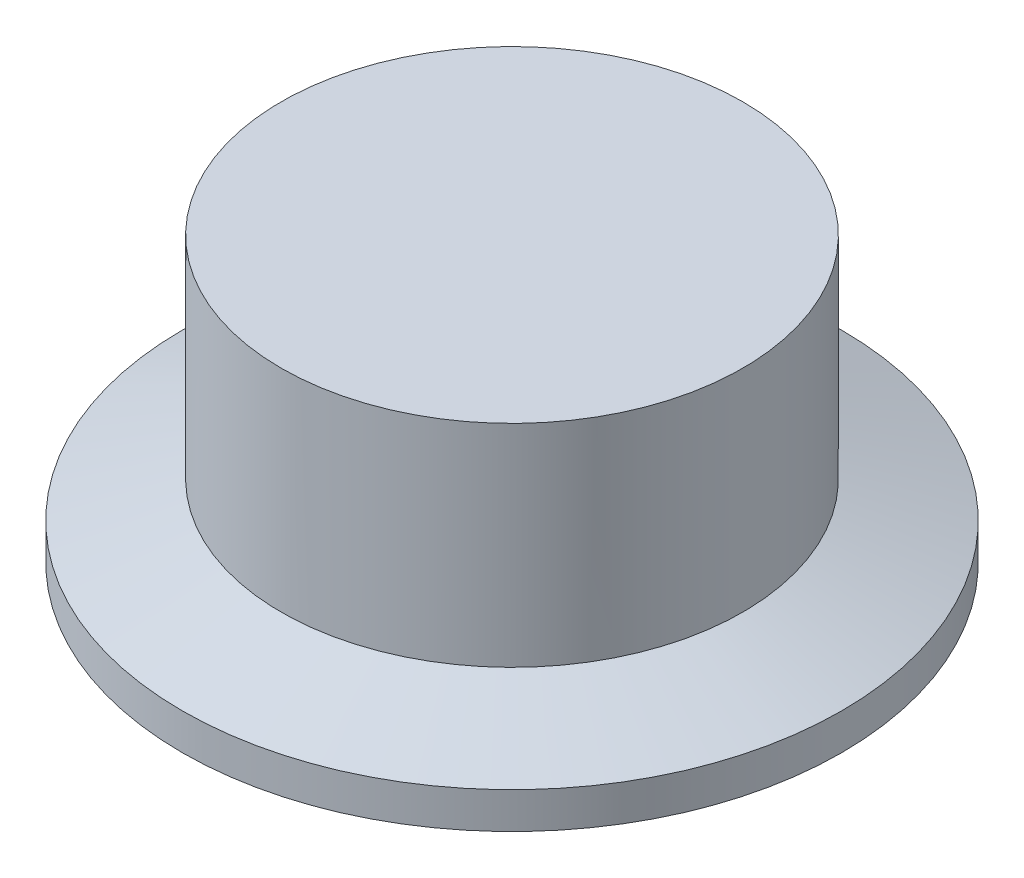
ISO-10303-21;
HEADER;
FILE_DESCRIPTION(('STEP AP214'),'2;1');
FILE_NAME('part.step','',(''),(''),'','','');
FILE_SCHEMA(('AUTOMOTIVE_DESIGN { 1 0 10303 214 1 1 1 1 }'));
ENDSEC;
DATA;
#1=APPLICATION_CONTEXT('core data for automotive mechanical design processes');
#2=APPLICATION_PROTOCOL_DEFINITION('international standard','automotive_design',2000,#1);
#3=PRODUCT_CONTEXT('',#1,'mechanical');
#4=PRODUCT('Part','Part','',(#3));
#5=PRODUCT_RELATED_PRODUCT_CATEGORY('part','',(#4));
#6=PRODUCT_DEFINITION_FORMATION('','',#4);
#7=PRODUCT_DEFINITION_CONTEXT('part definition',#1,'design');
#8=PRODUCT_DEFINITION('design','',#6,#7);
#9=PRODUCT_DEFINITION_SHAPE('','',#8);
#10=(LENGTH_UNIT() NAMED_UNIT(*) SI_UNIT(.MILLI.,.METRE.));
#11=(NAMED_UNIT(*) PLANE_ANGLE_UNIT() SI_UNIT($,.RADIAN.));
#12=(NAMED_UNIT(*) SI_UNIT($,.STERADIAN.) SOLID_ANGLE_UNIT());
#13=UNCERTAINTY_MEASURE_WITH_UNIT(LENGTH_MEASURE(1.E-05),#10,'distance_accuracy_value','');
#14=(GEOMETRIC_REPRESENTATION_CONTEXT(3) GLOBAL_UNCERTAINTY_ASSIGNED_CONTEXT((#13)) GLOBAL_UNIT_ASSIGNED_CONTEXT((#10,
#11,#12)) REPRESENTATION_CONTEXT('',''));
#15=CARTESIAN_POINT('',(0.,0.,0.));
#16=DIRECTION('',(0.,0.,1.));
#17=DIRECTION('',(1.,0.,0.));
#18=AXIS2_PLACEMENT_3D('',#15,#16,#17);
#19=CARTESIAN_POINT('',(0.,1.27000000000001,0.));
#20=CARTESIAN_POINT('',(-5.11970880183634,1.51290112684334,0.));
#21=CARTESIAN_POINT('',(-13.6851987767612,-0.496611023304067,0.));
#22=CARTESIAN_POINT('',(-22.1584771281244,-2.93975728273693,0.));
#23=CARTESIAN_POINT('',(-25.4,-4.82599999999999,0.));
#24=B_SPLINE_CURVE_WITH_KNOTS('',3,(#19,#20,#21,#22,#23),.UNSPECIFIED.,.F.,.F.,(4,1,4),(0.,
0.575798634465764,1.),.UNSPECIFIED.);
#25=CARTESIAN_POINT('',(0.,-18.3275304414003,0.));
#26=DIRECTION('',(0.,-1.,0.));
#27=AXIS1_PLACEMENT('',#25,#26);
#28=SURFACE_OF_REVOLUTION('',#24,#27);
#29=CARTESIAN_POINT('',(0.,-4.826,0.));
#30=DIRECTION('',(0.,1.,0.));
#31=DIRECTION('',(0.,0.,1.));
#32=AXIS2_PLACEMENT_3D('',#29,#30,#31);
#33=CIRCLE('',#32,25.4);
#34=CARTESIAN_POINT('',(0.,-4.826,25.4));
#35=VERTEX_POINT('',#34);
#36=EDGE_CURVE('E11',#35,#35,#33,.T.);
#37=ORIENTED_EDGE('',*,*,#36,.F.);
#38=EDGE_LOOP('',(#37));
#39=FACE_BOUND('',#38,.T.);
#40=CARTESIAN_POINT('',(0.,1.27000000000001,0.));
#41=VERTEX_POINT('',#40);
#42=VERTEX_LOOP('',#41);
#43=FACE_BOUND('',#42,.T.);
#44=ADVANCED_FACE('F39',(#39,#43),#28,.F.);
#45=CARTESIAN_POINT('',(0.,-17.526,0.));
#46=DIRECTION('',(0.,1.,0.));
#47=DIRECTION('',(0.,0.,1.));
#48=AXIS2_PLACEMENT_3D('',#45,#46,#47);
#49=CYLINDRICAL_SURFACE('',#48,25.4);
#50=CARTESIAN_POINT('',(0.,-2.032,0.));
#51=DIRECTION('',(0.,-1.,0.));
#52=DIRECTION('',(0.,0.,-1.));
#53=AXIS2_PLACEMENT_3D('',#50,#51,#52);
#54=CIRCLE('',#53,25.4);
#55=CARTESIAN_POINT('',(0.,-2.032,-25.4));
#56=VERTEX_POINT('',#55);
#57=EDGE_CURVE('E49',#56,#56,#54,.T.);
#58=ORIENTED_EDGE('',*,*,#57,.T.);
#59=EDGE_LOOP('',(#58));
#60=FACE_BOUND('',#59,.T.);
#61=ORIENTED_EDGE('',*,*,#36,.T.);
#62=EDGE_LOOP('',(#61));
#63=FACE_BOUND('',#62,.T.);
#64=ADVANCED_FACE('F53',(#60,#63),#49,.T.);
#65=CARTESIAN_POINT('',(0.,0.,0.));
#66=DIRECTION('',(0.,-1.,0.));
#67=DIRECTION('',(0.,0.,-1.));
#68=AXIS2_PLACEMENT_3D('',#65,#66,#67);
#69=CYLINDRICAL_SURFACE('',#68,17.78);
#70=CARTESIAN_POINT('',(0.,0.741453185108498,0.));
#71=DIRECTION('',(0.,-1.,0.));
#72=DIRECTION('',(0.,0.,-1.));
#73=AXIS2_PLACEMENT_3D('',#70,#71,#72);
#74=CIRCLE('',#73,17.78);
#75=CARTESIAN_POINT('',(0.,0.741453185108498,-17.78));
#76=VERTEX_POINT('',#75);
#77=EDGE_CURVE('E83',#76,#76,#74,.T.);
#78=ORIENTED_EDGE('',*,*,#77,.F.);
#79=EDGE_LOOP('',(#78));
#80=FACE_BOUND('',#79,.T.);
#81=CARTESIAN_POINT('',(0.,17.018,0.));
#82=DIRECTION('',(0.,1.,0.));
#83=DIRECTION('',(0.,0.,1.));
#84=AXIS2_PLACEMENT_3D('',#81,#82,#83);
#85=CIRCLE('',#84,17.78);
#86=CARTESIAN_POINT('',(0.,17.018,17.78));
#87=VERTEX_POINT('',#86);
#88=EDGE_CURVE('E80',#87,#87,#85,.T.);
#89=ORIENTED_EDGE('',*,*,#88,.F.);
#90=EDGE_LOOP('',(#89));
#91=FACE_BOUND('',#90,.T.);
#92=ADVANCED_FACE('F58',(#80,#91),#69,.T.);
#93=CARTESIAN_POINT('',(0.,0.741453185108498,0.));
#94=DIRECTION('',(0.,-1.,0.));
#95=DIRECTION('',(0.,0.,-1.));
#96=AXIS2_PLACEMENT_3D('',#93,#94,#95);
#97=CONICAL_SURFACE('',#96,17.78,1.22173047639603);
#98=ORIENTED_EDGE('',*,*,#57,.F.);
#99=EDGE_LOOP('',(#98));
#100=FACE_BOUND('',#99,.T.);
#101=ORIENTED_EDGE('',*,*,#77,.T.);
#102=EDGE_LOOP('',(#101));
#103=FACE_BOUND('',#102,.T.);
#104=ADVANCED_FACE('F65',(#100,#103),#97,.T.);
#105=CARTESIAN_POINT('',(0.,17.018,0.));
#106=DIRECTION('',(0.,1.,0.));
#107=DIRECTION('',(0.,0.,1.));
#108=AXIS2_PLACEMENT_3D('',#105,#106,#107);
#109=PLANE('',#108);
#110=ORIENTED_EDGE('',*,*,#88,.T.);
#111=EDGE_LOOP('',(#110));
#112=FACE_BOUND('',#111,.T.);
#113=ADVANCED_FACE('F72',(#112),#109,.T.);
#114=CLOSED_SHELL('',(#44,#64,#92,#104,#113));
#115=MANIFOLD_SOLID_BREP('B2',#114);
#116=ADVANCED_BREP_SHAPE_REPRESENTATION('',(#18,#115),#14);
#117=SHAPE_DEFINITION_REPRESENTATION(#9,#116);
ENDSEC;
END-ISO-10303-21;
